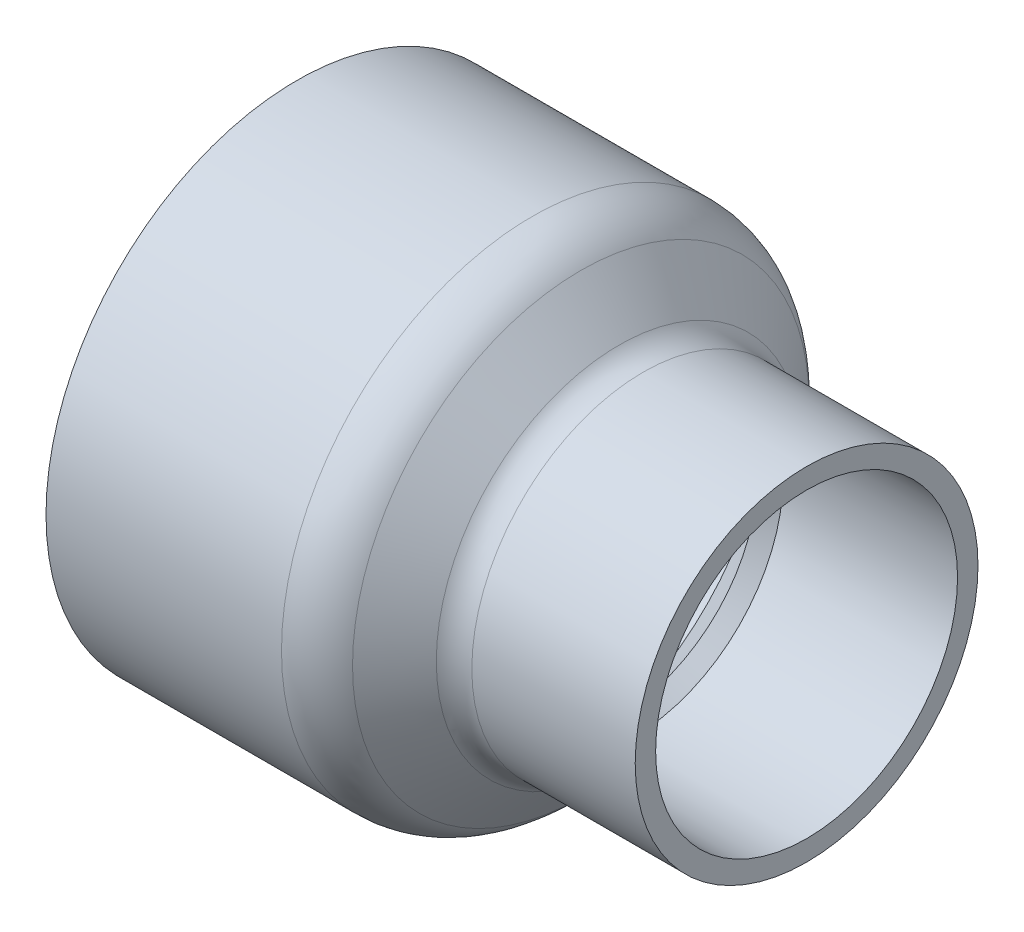
ISO-10303-21;
HEADER;
FILE_DESCRIPTION(('STEP AP214'),'2;1');
FILE_NAME('part.step','',(''),(''),'','','');
FILE_SCHEMA(('AUTOMOTIVE_DESIGN { 1 0 10303 214 1 1 1 1 }'));
ENDSEC;
DATA;
#1=APPLICATION_CONTEXT('core data for automotive mechanical design processes');
#2=APPLICATION_PROTOCOL_DEFINITION('international standard','automotive_design',2000,#1);
#3=PRODUCT_CONTEXT('',#1,'mechanical');
#4=PRODUCT('Part','Part','',(#3));
#5=PRODUCT_RELATED_PRODUCT_CATEGORY('part','',(#4));
#6=PRODUCT_DEFINITION_FORMATION('','',#4);
#7=PRODUCT_DEFINITION_CONTEXT('part definition',#1,'design');
#8=PRODUCT_DEFINITION('design','',#6,#7);
#9=PRODUCT_DEFINITION_SHAPE('','',#8);
#10=(LENGTH_UNIT() NAMED_UNIT(*) SI_UNIT(.MILLI.,.METRE.));
#11=(NAMED_UNIT(*) PLANE_ANGLE_UNIT() SI_UNIT($,.RADIAN.));
#12=(NAMED_UNIT(*) SI_UNIT($,.STERADIAN.) SOLID_ANGLE_UNIT());
#13=UNCERTAINTY_MEASURE_WITH_UNIT(LENGTH_MEASURE(1.E-05),#10,'distance_accuracy_value','');
#14=(GEOMETRIC_REPRESENTATION_CONTEXT(3) GLOBAL_UNCERTAINTY_ASSIGNED_CONTEXT((#13)) GLOBAL_UNIT_ASSIGNED_CONTEXT((#10,
#11,#12)) REPRESENTATION_CONTEXT('',''));
#15=CARTESIAN_POINT('',(0.,0.,0.));
#16=DIRECTION('',(0.,0.,1.));
#17=DIRECTION('',(1.,0.,0.));
#18=AXIS2_PLACEMENT_3D('',#15,#16,#17);
#19=CARTESIAN_POINT('',(-51.181,0.,0.));
#20=DIRECTION('',(-1.,0.,0.));
#21=DIRECTION('',(0.,0.,1.));
#22=AXIS2_PLACEMENT_3D('',#19,#20,#21);
#23=CYLINDRICAL_SURFACE('',#22,50.3682);
#24=CARTESIAN_POINT('',(-3.89391655979553,0.,0.));
#25=DIRECTION('',(1.,0.,0.));
#26=DIRECTION('',(0.,0.,-1.));
#27=AXIS2_PLACEMENT_3D('',#24,#25,#26);
#28=CIRCLE('',#27,50.3682);
#29=CARTESIAN_POINT('',(-3.89391655979553,0.,-50.3682));
#30=VERTEX_POINT('',#29);
#31=EDGE_CURVE('E45',#30,#30,#28,.F.);
#32=ORIENTED_EDGE('',*,*,#31,.T.);
#33=EDGE_LOOP('',(#32));
#34=FACE_BOUND('',#33,.T.);
#35=CARTESIAN_POINT('',(-51.181,0.,0.));
#36=DIRECTION('',(-1.,0.,0.));
#37=DIRECTION('',(0.,0.,1.));
#38=AXIS2_PLACEMENT_3D('',#35,#36,#37);
#39=CIRCLE('',#38,50.3682);
#40=CARTESIAN_POINT('',(-51.181,0.,50.3682));
#41=VERTEX_POINT('',#40);
#42=EDGE_CURVE('E50',#41,#41,#39,.T.);
#43=ORIENTED_EDGE('',*,*,#42,.F.);
#44=EDGE_LOOP('',(#43));
#45=FACE_BOUND('',#44,.T.);
#46=ADVANCED_FACE('F30',(#34,#45),#23,.T.);
#47=CARTESIAN_POINT('',(-51.181,-50.3682,0.));
#48=DIRECTION('',(-1.,0.,0.));
#49=DIRECTION('',(0.,0.,1.));
#50=AXIS2_PLACEMENT_3D('',#47,#48,#49);
#51=PLANE('',#50);
#52=ORIENTED_EDGE('',*,*,#42,.T.);
#53=EDGE_LOOP('',(#52));
#54=FACE_BOUND('',#53,.T.);
#55=CARTESIAN_POINT('',(-51.181,0.,0.));
#56=DIRECTION('',(-1.,0.,0.));
#57=DIRECTION('',(0.,0.,1.));
#58=AXIS2_PLACEMENT_3D('',#55,#56,#57);
#59=CIRCLE('',#58,44.6532);
#60=CARTESIAN_POINT('',(-51.181,0.,44.6532));
#61=VERTEX_POINT('',#60);
#62=EDGE_CURVE('E53',#61,#61,#59,.T.);
#63=ORIENTED_EDGE('',*,*,#62,.F.);
#64=EDGE_LOOP('',(#63));
#65=FACE_BOUND('',#64,.T.);
#66=ADVANCED_FACE('F89',(#54,#65),#51,.T.);
#67=CARTESIAN_POINT('',(-0.380999999999999,0.,0.));
#68=DIRECTION('',(-1.,0.,0.));
#69=DIRECTION('',(0.,0.,1.));
#70=AXIS2_PLACEMENT_3D('',#67,#68,#69);
#71=CONICAL_SURFACE('',#70,44.3484,0.00599992800155518);
#72=ORIENTED_EDGE('',*,*,#62,.T.);
#73=EDGE_LOOP('',(#72));
#74=FACE_BOUND('',#73,.T.);
#75=CARTESIAN_POINT('',(-0.380999999999999,0.,0.));
#76=DIRECTION('',(-1.,0.,0.));
#77=DIRECTION('',(0.,0.,1.));
#78=AXIS2_PLACEMENT_3D('',#75,#76,#77);
#79=CIRCLE('',#78,44.3484);
#80=CARTESIAN_POINT('',(-0.380999999999999,0.,44.3484));
#81=VERTEX_POINT('',#80);
#82=EDGE_CURVE('E56',#81,#81,#79,.T.);
#83=ORIENTED_EDGE('',*,*,#82,.F.);
#84=EDGE_LOOP('',(#83));
#85=FACE_BOUND('',#84,.T.);
#86=ADVANCED_FACE('F95',(#74,#85),#71,.F.);
#87=CARTESIAN_POINT('',(13.5681943019134,0.,0.));
#88=DIRECTION('',(-1.,0.,0.));
#89=DIRECTION('',(0.,0.,1.));
#90=AXIS2_PLACEMENT_3D('',#87,#88,#89);
#91=CONICAL_SURFACE('',#90,27.7243975768998,0.87266462599717);
#92=ORIENTED_EDGE('',*,*,#82,.T.);
#93=EDGE_LOOP('',(#92));
#94=FACE_BOUND('',#93,.T.);
#95=CARTESIAN_POINT('',(13.5681943019134,0.,0.));
#96=DIRECTION('',(-1.,0.,0.));
#97=DIRECTION('',(0.,0.,1.));
#98=AXIS2_PLACEMENT_3D('',#95,#96,#97);
#99=CIRCLE('',#98,27.7243975768998);
#100=CARTESIAN_POINT('',(13.5681943019134,0.,27.7243975768998));
#101=VERTEX_POINT('',#100);
#102=EDGE_CURVE('E59',#101,#101,#99,.T.);
#103=ORIENTED_EDGE('',*,*,#102,.F.);
#104=EDGE_LOOP('',(#103));
#105=FACE_BOUND('',#104,.T.);
#106=ADVANCED_FACE('F149',(#94,#105),#91,.F.);
#107=CARTESIAN_POINT('',(16.383,0.,0.));
#108=DIRECTION('',(1.,0.,0.));
#109=DIRECTION('',(0.,0.,-1.));
#110=AXIS2_PLACEMENT_3D('',#107,#108,#109);
#111=CONICAL_SURFACE('',#110,30.0863,0.698131700797726);
#112=ORIENTED_EDGE('',*,*,#102,.T.);
#113=EDGE_LOOP('',(#112));
#114=FACE_BOUND('',#113,.T.);
#115=CARTESIAN_POINT('',(16.383,0.,0.));
#116=DIRECTION('',(-1.,0.,0.));
#117=DIRECTION('',(0.,0.,1.));
#118=AXIS2_PLACEMENT_3D('',#115,#116,#117);
#119=CIRCLE('',#118,30.0863);
#120=CARTESIAN_POINT('',(16.383,0.,30.0863));
#121=VERTEX_POINT('',#120);
#122=EDGE_CURVE('E62',#121,#121,#119,.T.);
#123=ORIENTED_EDGE('',*,*,#122,.F.);
#124=EDGE_LOOP('',(#123));
#125=FACE_BOUND('',#124,.T.);
#126=ADVANCED_FACE('F85',(#114,#125),#111,.F.);
#127=CARTESIAN_POINT('',(51.181,0.,0.));
#128=DIRECTION('',(1.,0.,0.));
#129=DIRECTION('',(0.,0.,-1.));
#130=AXIS2_PLACEMENT_3D('',#127,#128,#129);
#131=CONICAL_SURFACE('',#130,30.3149,0.00656924856536292);
#132=ORIENTED_EDGE('',*,*,#122,.T.);
#133=EDGE_LOOP('',(#132));
#134=FACE_BOUND('',#133,.T.);
#135=CARTESIAN_POINT('',(51.181,0.,0.));
#136=DIRECTION('',(-1.,0.,0.));
#137=DIRECTION('',(0.,0.,1.));
#138=AXIS2_PLACEMENT_3D('',#135,#136,#137);
#139=CIRCLE('',#138,30.3149);
#140=CARTESIAN_POINT('',(51.181,0.,30.3149));
#141=VERTEX_POINT('',#140);
#142=EDGE_CURVE('E65',#141,#141,#139,.T.);
#143=ORIENTED_EDGE('',*,*,#142,.F.);
#144=EDGE_LOOP('',(#143));
#145=FACE_BOUND('',#144,.T.);
#146=ADVANCED_FACE('F76',(#134,#145),#131,.F.);
#147=CARTESIAN_POINT('',(51.181,-30.3149,0.));
#148=DIRECTION('',(1.,0.,0.));
#149=DIRECTION('',(0.,0.,-1.));
#150=AXIS2_PLACEMENT_3D('',#147,#148,#149);
#151=PLANE('',#150);
#152=ORIENTED_EDGE('',*,*,#142,.T.);
#153=EDGE_LOOP('',(#152));
#154=FACE_BOUND('',#153,.T.);
#155=CARTESIAN_POINT('',(51.181,0.,0.));
#156=DIRECTION('',(-1.,0.,0.));
#157=DIRECTION('',(0.,0.,1.));
#158=AXIS2_PLACEMENT_3D('',#155,#156,#157);
#159=CIRCLE('',#158,34.417);
#160=CARTESIAN_POINT('',(51.181,0.,34.417));
#161=VERTEX_POINT('',#160);
#162=EDGE_CURVE('E68',#161,#161,#159,.T.);
#163=ORIENTED_EDGE('',*,*,#162,.F.);
#164=EDGE_LOOP('',(#163));
#165=FACE_BOUND('',#164,.T.);
#166=ADVANCED_FACE('F74',(#154,#165),#151,.T.);
#167=CARTESIAN_POINT('',(-51.181,0.,0.));
#168=DIRECTION('',(-1.,0.,0.));
#169=DIRECTION('',(0.,0.,1.));
#170=AXIS2_PLACEMENT_3D('',#167,#168,#169);
#171=CYLINDRICAL_SURFACE('',#170,34.417);
#172=CARTESIAN_POINT('',(18.3738903648921,0.,0.));
#173=DIRECTION('',(-1.,0.,0.));
#174=DIRECTION('',(0.,0.,1.));
#175=AXIS2_PLACEMENT_3D('',#172,#173,#174);
#176=CIRCLE('',#175,34.417);
#177=CARTESIAN_POINT('',(18.3738903648921,0.,34.417));
#178=VERTEX_POINT('',#177);
#179=EDGE_CURVE('E10',#178,#178,#176,.F.);
#180=ORIENTED_EDGE('',*,*,#179,.T.);
#181=EDGE_LOOP('',(#180));
#182=FACE_BOUND('',#181,.T.);
#183=ORIENTED_EDGE('',*,*,#162,.T.);
#184=EDGE_LOOP('',(#183));
#185=FACE_BOUND('',#184,.T.);
#186=ADVANCED_FACE('F72',(#182,#185),#171,.T.);
#187=CARTESIAN_POINT('',(2.028190698773,0.,0.));
#188=DIRECTION('',(-1.,0.,0.));
#189=DIRECTION('',(0.,0.,1.));
#190=AXIS2_PLACEMENT_3D('',#187,#188,#189);
#191=CONICAL_SURFACE('',#190,50.3682,0.872664625997171);
#192=CARTESIAN_POINT('',(13.5095081510866,0.,0.));
#193=DIRECTION('',(-1.,0.,0.));
#194=DIRECTION('',(0.,0.,1.));
#195=AXIS2_PLACEMENT_3D('',#192,#193,#194);
#196=CIRCLE('',#195,36.6852986784905);
#197=CARTESIAN_POINT('',(13.5095081510866,0.,36.6852986784905));
#198=VERTEX_POINT('',#197);
#199=EDGE_CURVE('E37',#198,#198,#196,.T.);
#200=ORIENTED_EDGE('',*,*,#199,.T.);
#201=EDGE_LOOP('',(#200));
#202=FACE_BOUND('',#201,.T.);
#203=CARTESIAN_POINT('',(5.83484786781555,0.,0.));
#204=DIRECTION('',(1.,0.,0.));
#205=DIRECTION('',(0.,0.,-1.));
#206=AXIS2_PLACEMENT_3D('',#203,#204,#205);
#207=CIRCLE('',#206,45.831602643019);
#208=CARTESIAN_POINT('',(5.83484786781555,0.,-45.831602643019));
#209=VERTEX_POINT('',#208);
#210=EDGE_CURVE('E41',#209,#209,#207,.T.);
#211=ORIENTED_EDGE('',*,*,#210,.T.);
#212=EDGE_LOOP('',(#211));
#213=FACE_BOUND('',#212,.T.);
#214=ADVANCED_FACE('F83',(#202,#213),#191,.T.);
#215=CARTESIAN_POINT('',(-3.89391655979553,0.,0.));
#216=DIRECTION('',(1.,0.,0.));
#217=DIRECTION('',(0.,0.,-1.));
#218=AXIS2_PLACEMENT_3D('',#215,#216,#217);
#219=TOROIDAL_SURFACE('',#218,37.6682,12.7);
#220=ORIENTED_EDGE('',*,*,#210,.F.);
#221=EDGE_LOOP('',(#220));
#222=FACE_BOUND('',#221,.T.);
#223=ORIENTED_EDGE('',*,*,#31,.F.);
#224=EDGE_LOOP('',(#223));
#225=FACE_BOUND('',#224,.T.);
#226=ADVANCED_FACE('F100',(#222,#225),#219,.T.);
#227=CARTESIAN_POINT('',(18.3738903648921,0.,0.));
#228=DIRECTION('',(-1.,0.,0.));
#229=DIRECTION('',(0.,0.,1.));
#230=AXIS2_PLACEMENT_3D('',#227,#228,#229);
#231=TOROIDAL_SURFACE('',#230,40.767,6.35);
#232=ORIENTED_EDGE('',*,*,#179,.F.);
#233=EDGE_LOOP('',(#232));
#234=FACE_BOUND('',#233,.T.);
#235=ORIENTED_EDGE('',*,*,#199,.F.);
#236=EDGE_LOOP('',(#235));
#237=FACE_BOUND('',#236,.T.);
#238=ADVANCED_FACE('F32',(#234,#237),#231,.F.);
#239=CLOSED_SHELL('',(#46,#66,#86,#106,#126,#146,#166,#186,#214,#226,#238));
#240=MANIFOLD_SOLID_BREP('B2',#239);
#241=ADVANCED_BREP_SHAPE_REPRESENTATION('',(#18,#240),#14);
#242=SHAPE_DEFINITION_REPRESENTATION(#9,#241);
ENDSEC;
END-ISO-10303-21;
